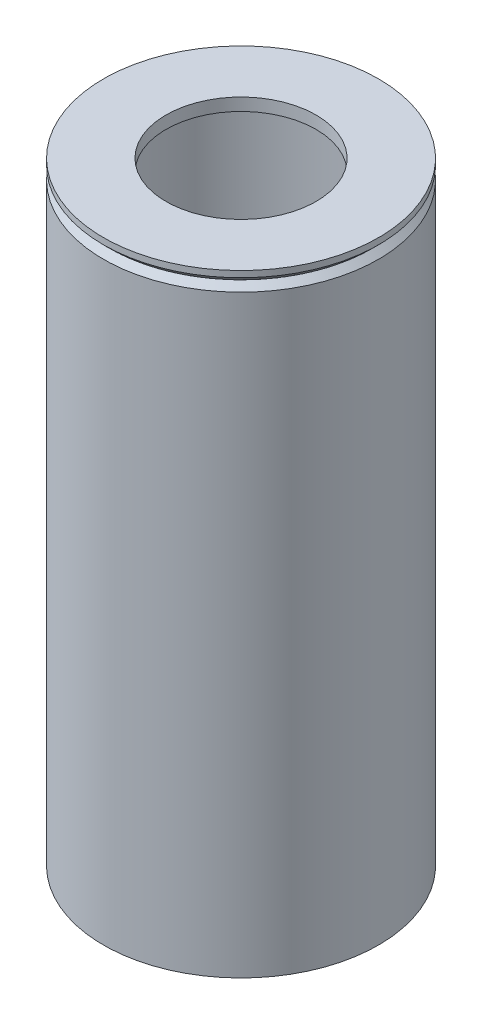
ISO-10303-21;
HEADER;
FILE_DESCRIPTION(('STEP AP214'),'2;1');
FILE_NAME('part.step','',(''),(''),'','','');
FILE_SCHEMA(('AUTOMOTIVE_DESIGN { 1 0 10303 214 1 1 1 1 }'));
ENDSEC;
DATA;
#1=APPLICATION_CONTEXT('core data for automotive mechanical design processes');
#2=APPLICATION_PROTOCOL_DEFINITION('international standard','automotive_design',2000,#1);
#3=PRODUCT_CONTEXT('',#1,'mechanical');
#4=PRODUCT('Part','Part','',(#3));
#5=PRODUCT_RELATED_PRODUCT_CATEGORY('part','',(#4));
#6=PRODUCT_DEFINITION_FORMATION('','',#4);
#7=PRODUCT_DEFINITION_CONTEXT('part definition',#1,'design');
#8=PRODUCT_DEFINITION('design','',#6,#7);
#9=PRODUCT_DEFINITION_SHAPE('','',#8);
#10=(LENGTH_UNIT() NAMED_UNIT(*) SI_UNIT(.MILLI.,.METRE.));
#11=(NAMED_UNIT(*) PLANE_ANGLE_UNIT() SI_UNIT($,.RADIAN.));
#12=(NAMED_UNIT(*) SI_UNIT($,.STERADIAN.) SOLID_ANGLE_UNIT());
#13=UNCERTAINTY_MEASURE_WITH_UNIT(LENGTH_MEASURE(1.E-05),#10,'distance_accuracy_value','');
#14=(GEOMETRIC_REPRESENTATION_CONTEXT(3) GLOBAL_UNCERTAINTY_ASSIGNED_CONTEXT((#13)) GLOBAL_UNIT_ASSIGNED_CONTEXT((#10,
#11,#12)) REPRESENTATION_CONTEXT('',''));
#15=CARTESIAN_POINT('',(0.,0.,0.));
#16=DIRECTION('',(0.,0.,1.));
#17=DIRECTION('',(1.,0.,0.));
#18=AXIS2_PLACEMENT_3D('',#15,#16,#17);
#19=CARTESIAN_POINT('',(0.,0.,0.));
#20=DIRECTION('',(0.,-1.,0.));
#21=DIRECTION('',(0.,0.,-1.));
#22=AXIS2_PLACEMENT_3D('',#19,#20,#21);
#23=CYLINDRICAL_SURFACE('',#22,69.85);
#24=CARTESIAN_POINT('',(0.,3.17500000000004,0.));
#25=DIRECTION('',(0.,1.,0.));
#26=DIRECTION('',(0.,0.,1.));
#27=AXIS2_PLACEMENT_3D('',#24,#25,#26);
#28=CIRCLE('',#27,69.85);
#29=CARTESIAN_POINT('',(0.,3.17500000000004,69.85));
#30=VERTEX_POINT('',#29);
#31=EDGE_CURVE('E11',#30,#30,#28,.T.);
#32=ORIENTED_EDGE('',*,*,#31,.T.);
#33=EDGE_LOOP('',(#32));
#34=FACE_BOUND('',#33,.T.);
#35=CARTESIAN_POINT('',(0.,6.35,0.));
#36=DIRECTION('',(0.,-1.,0.));
#37=DIRECTION('',(0.,0.,-1.));
#38=AXIS2_PLACEMENT_3D('',#35,#36,#37);
#39=CIRCLE('',#38,69.85);
#40=CARTESIAN_POINT('',(0.,6.35,-69.85));
#41=VERTEX_POINT('',#40);
#42=EDGE_CURVE('E59',#41,#41,#39,.T.);
#43=ORIENTED_EDGE('',*,*,#42,.T.);
#44=EDGE_LOOP('',(#43));
#45=FACE_BOUND('',#44,.T.);
#46=ADVANCED_FACE('F47',(#34,#45),#23,.T.);
#47=CARTESIAN_POINT('',(-69.85,6.35,0.));
#48=DIRECTION('',(0.,-1.,0.));
#49=DIRECTION('',(0.,0.,-1.));
#50=AXIS2_PLACEMENT_3D('',#47,#48,#49);
#51=PLANE('',#50);
#52=ORIENTED_EDGE('',*,*,#42,.F.);
#53=EDGE_LOOP('',(#52));
#54=FACE_BOUND('',#53,.T.);
#55=CARTESIAN_POINT('',(0.,6.35,0.));
#56=DIRECTION('',(0.,-1.,0.));
#57=DIRECTION('',(0.,0.,-1.));
#58=AXIS2_PLACEMENT_3D('',#55,#56,#57);
#59=CIRCLE('',#58,38.1);
#60=CARTESIAN_POINT('',(0.,6.35,-38.1));
#61=VERTEX_POINT('',#60);
#62=EDGE_CURVE('E63',#61,#61,#59,.T.);
#63=ORIENTED_EDGE('',*,*,#62,.T.);
#64=EDGE_LOOP('',(#63));
#65=FACE_BOUND('',#64,.T.);
#66=ADVANCED_FACE('F82',(#54,#65),#51,.F.);
#67=CARTESIAN_POINT('',(0.,0.,0.));
#68=DIRECTION('',(0.,-1.,0.));
#69=DIRECTION('',(0.,0.,-1.));
#70=AXIS2_PLACEMENT_3D('',#67,#68,#69);
#71=CYLINDRICAL_SURFACE('',#70,38.1);
#72=ORIENTED_EDGE('',*,*,#62,.F.);
#73=EDGE_LOOP('',(#72));
#74=FACE_BOUND('',#73,.T.);
#75=CARTESIAN_POINT('',(0.,0.,0.));
#76=DIRECTION('',(0.,-1.,0.));
#77=DIRECTION('',(0.,0.,-1.));
#78=AXIS2_PLACEMENT_3D('',#75,#76,#77);
#79=CIRCLE('',#78,38.1);
#80=CARTESIAN_POINT('',(0.,0.,-38.1));
#81=VERTEX_POINT('',#80);
#82=EDGE_CURVE('E68',#81,#81,#79,.T.);
#83=ORIENTED_EDGE('',*,*,#82,.T.);
#84=EDGE_LOOP('',(#83));
#85=FACE_BOUND('',#84,.T.);
#86=ADVANCED_FACE('F72',(#74,#85),#71,.F.);
#87=CARTESIAN_POINT('',(-38.1,0.,0.));
#88=DIRECTION('',(0.,1.,0.));
#89=DIRECTION('',(0.,0.,1.));
#90=AXIS2_PLACEMENT_3D('',#87,#88,#89);
#91=PLANE('',#90);
#92=CARTESIAN_POINT('',(0.,0.,0.));
#93=DIRECTION('',(0.,1.,0.));
#94=DIRECTION('',(0.,0.,1.));
#95=AXIS2_PLACEMENT_3D('',#92,#93,#94);
#96=CIRCLE('',#95,66.675);
#97=CARTESIAN_POINT('',(0.,0.,66.675));
#98=VERTEX_POINT('',#97);
#99=EDGE_CURVE('E55',#98,#98,#96,.F.);
#100=ORIENTED_EDGE('',*,*,#99,.T.);
#101=EDGE_LOOP('',(#100));
#102=FACE_BOUND('',#101,.T.);
#103=ORIENTED_EDGE('',*,*,#82,.F.);
#104=EDGE_LOOP('',(#103));
#105=FACE_BOUND('',#104,.T.);
#106=ADVANCED_FACE('F74',(#102,#105),#91,.F.);
#107=CARTESIAN_POINT('',(0.,0.,0.));
#108=DIRECTION('',(0.,1.,0.));
#109=DIRECTION('',(0.,0.,1.));
#110=AXIS2_PLACEMENT_3D('',#107,#108,#109);
#111=CONICAL_SURFACE('',#110,66.675,0.785398163397446);
#112=ORIENTED_EDGE('',*,*,#31,.F.);
#113=EDGE_LOOP('',(#112));
#114=FACE_BOUND('',#113,.T.);
#115=ORIENTED_EDGE('',*,*,#99,.F.);
#116=EDGE_LOOP('',(#115));
#117=FACE_BOUND('',#116,.T.);
#118=ADVANCED_FACE('F50',(#114,#117),#111,.T.);
#119=CLOSED_SHELL('',(#46,#66,#86,#106,#118));
#120=MANIFOLD_SOLID_BREP('B2',#119);
#121=CARTESIAN_POINT('',(-63.5,0.,0.));
#122=DIRECTION('',(0.,-1.,0.));
#123=DIRECTION('',(0.,0.,-1.));
#124=AXIS2_PLACEMENT_3D('',#121,#122,#123);
#125=PLANE('',#124);
#126=CARTESIAN_POINT('',(0.,0.,0.));
#127=DIRECTION('',(0.,-1.,0.));
#128=DIRECTION('',(0.,0.,-1.));
#129=AXIS2_PLACEMENT_3D('',#126,#127,#128);
#130=CIRCLE('',#129,66.6749999999999);
#131=CARTESIAN_POINT('',(0.,0.,-66.6749999999999));
#132=VERTEX_POINT('',#131);
#133=EDGE_CURVE('E46',#132,#132,#130,.F.);
#134=ORIENTED_EDGE('',*,*,#133,.T.);
#135=EDGE_LOOP('',(#134));
#136=FACE_BOUND('',#135,.T.);
#137=CARTESIAN_POINT('',(0.,0.,0.));
#138=DIRECTION('',(0.,-1.,0.));
#139=DIRECTION('',(0.,0.,-1.));
#140=AXIS2_PLACEMENT_3D('',#137,#138,#139);
#141=CIRCLE('',#140,63.5);
#142=CARTESIAN_POINT('',(0.,0.,-63.5));
#143=VERTEX_POINT('',#142);
#144=EDGE_CURVE('E152',#143,#143,#141,.T.);
#145=ORIENTED_EDGE('',*,*,#144,.T.);
#146=EDGE_LOOP('',(#145));
#147=FACE_BOUND('',#146,.T.);
#148=ADVANCED_FACE('F127',(#136,#147),#125,.F.);
#149=CARTESIAN_POINT('',(0.,0.,0.));
#150=DIRECTION('',(0.,-1.,0.));
#151=DIRECTION('',(0.,0.,-1.));
#152=AXIS2_PLACEMENT_3D('',#149,#150,#151);
#153=CYLINDRICAL_SURFACE('',#152,69.85);
#154=CARTESIAN_POINT('',(0.,-3.17500000000004,0.));
#155=DIRECTION('',(0.,-1.,0.));
#156=DIRECTION('',(0.,0.,-1.));
#157=AXIS2_PLACEMENT_3D('',#154,#155,#156);
#158=CIRCLE('',#157,69.85);
#159=CARTESIAN_POINT('',(0.,-3.17500000000004,-69.85));
#160=VERTEX_POINT('',#159);
#161=EDGE_CURVE('E136',#160,#160,#158,.T.);
#162=ORIENTED_EDGE('',*,*,#161,.T.);
#163=EDGE_LOOP('',(#162));
#164=FACE_BOUND('',#163,.T.);
#165=CARTESIAN_POINT('',(0.,-304.8,0.));
#166=DIRECTION('',(0.,-1.,0.));
#167=DIRECTION('',(0.,0.,-1.));
#168=AXIS2_PLACEMENT_3D('',#165,#166,#167);
#169=CIRCLE('',#168,69.85);
#170=CARTESIAN_POINT('',(0.,-304.8,-69.85));
#171=VERTEX_POINT('',#170);
#172=EDGE_CURVE('E141',#171,#171,#169,.T.);
#173=ORIENTED_EDGE('',*,*,#172,.F.);
#174=EDGE_LOOP('',(#173));
#175=FACE_BOUND('',#174,.T.);
#176=ADVANCED_FACE('F167',(#164,#175),#153,.T.);
#177=CARTESIAN_POINT('',(-69.85,-304.8,0.));
#178=DIRECTION('',(0.,1.,0.));
#179=DIRECTION('',(0.,0.,1.));
#180=AXIS2_PLACEMENT_3D('',#177,#178,#179);
#181=PLANE('',#180);
#182=CARTESIAN_POINT('',(0.,-304.8,0.));
#183=DIRECTION('',(0.,-1.,0.));
#184=DIRECTION('',(0.,0.,-1.));
#185=AXIS2_PLACEMENT_3D('',#182,#183,#184);
#186=CIRCLE('',#185,63.5);
#187=CARTESIAN_POINT('',(0.,-304.8,-63.5));
#188=VERTEX_POINT('',#187);
#189=EDGE_CURVE('E146',#188,#188,#186,.T.);
#190=ORIENTED_EDGE('',*,*,#189,.F.);
#191=EDGE_LOOP('',(#190));
#192=FACE_BOUND('',#191,.T.);
#193=ORIENTED_EDGE('',*,*,#172,.T.);
#194=EDGE_LOOP('',(#193));
#195=FACE_BOUND('',#194,.T.);
#196=ADVANCED_FACE('F161',(#192,#195),#181,.F.);
#197=CARTESIAN_POINT('',(0.,0.,0.));
#198=DIRECTION('',(0.,-1.,0.));
#199=DIRECTION('',(0.,0.,-1.));
#200=AXIS2_PLACEMENT_3D('',#197,#198,#199);
#201=CYLINDRICAL_SURFACE('',#200,63.5);
#202=ORIENTED_EDGE('',*,*,#144,.F.);
#203=EDGE_LOOP('',(#202));
#204=FACE_BOUND('',#203,.T.);
#205=ORIENTED_EDGE('',*,*,#189,.T.);
#206=EDGE_LOOP('',(#205));
#207=FACE_BOUND('',#206,.T.);
#208=ADVANCED_FACE('F158',(#204,#207),#201,.F.);
#209=CARTESIAN_POINT('',(0.,-3.17500000000004,0.));
#210=DIRECTION('',(0.,-1.,0.));
#211=DIRECTION('',(0.,0.,-1.));
#212=AXIS2_PLACEMENT_3D('',#209,#210,#211);
#213=CONICAL_SURFACE('',#212,69.85,0.78539816339745);
#214=ORIENTED_EDGE('',*,*,#133,.F.);
#215=EDGE_LOOP('',(#214));
#216=FACE_BOUND('',#215,.T.);
#217=ORIENTED_EDGE('',*,*,#161,.F.);
#218=EDGE_LOOP('',(#217));
#219=FACE_BOUND('',#218,.T.);
#220=ADVANCED_FACE('F130',(#216,#219),#213,.T.);
#221=CLOSED_SHELL('',(#148,#176,#196,#208,#220));
#222=MANIFOLD_SOLID_BREP('B6',#221);
#223=ADVANCED_BREP_SHAPE_REPRESENTATION('',(#18,#120,#222),#14);
#224=SHAPE_DEFINITION_REPRESENTATION(#9,#223);
ENDSEC;
END-ISO-10303-21;
